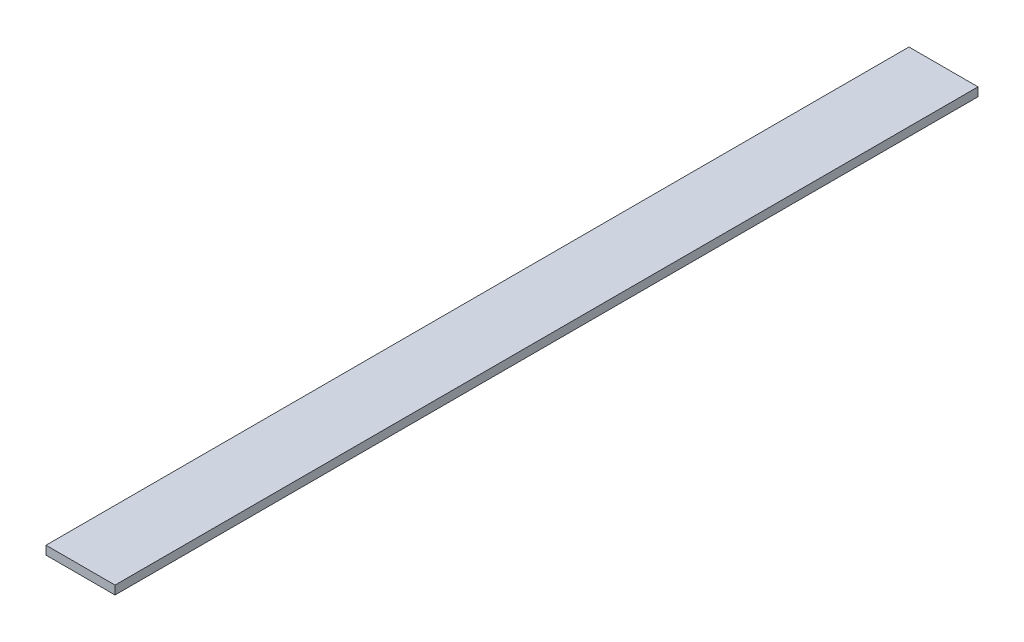
ISO-10303-21;
HEADER;
FILE_DESCRIPTION(('STEP AP214'),'2;1');
FILE_NAME('part.step','',(''),(''),'','','');
FILE_SCHEMA(('AUTOMOTIVE_DESIGN { 1 0 10303 214 1 1 1 1 }'));
ENDSEC;
DATA;
#1=APPLICATION_CONTEXT('core data for automotive mechanical design processes');
#2=APPLICATION_PROTOCOL_DEFINITION('international standard','automotive_design',2000,#1);
#3=PRODUCT_CONTEXT('',#1,'mechanical');
#4=PRODUCT('Part','Part','',(#3));
#5=PRODUCT_RELATED_PRODUCT_CATEGORY('part','',(#4));
#6=PRODUCT_DEFINITION_FORMATION('','',#4);
#7=PRODUCT_DEFINITION_CONTEXT('part definition',#1,'design');
#8=PRODUCT_DEFINITION('design','',#6,#7);
#9=PRODUCT_DEFINITION_SHAPE('','',#8);
#10=(LENGTH_UNIT() NAMED_UNIT(*) SI_UNIT(.MILLI.,.METRE.));
#11=(NAMED_UNIT(*) PLANE_ANGLE_UNIT() SI_UNIT($,.RADIAN.));
#12=(NAMED_UNIT(*) SI_UNIT($,.STERADIAN.) SOLID_ANGLE_UNIT());
#13=UNCERTAINTY_MEASURE_WITH_UNIT(LENGTH_MEASURE(1.E-05),#10,'distance_accuracy_value','');
#14=(GEOMETRIC_REPRESENTATION_CONTEXT(3) GLOBAL_UNCERTAINTY_ASSIGNED_CONTEXT((#13)) GLOBAL_UNIT_ASSIGNED_CONTEXT((#10,
#11,#12)) REPRESENTATION_CONTEXT('',''));
#15=CARTESIAN_POINT('',(0.,0.,0.));
#16=DIRECTION('',(0.,0.,1.));
#17=DIRECTION('',(1.,0.,0.));
#18=AXIS2_PLACEMENT_3D('',#15,#16,#17);
#19=CARTESIAN_POINT('',(0.,0.,500.));
#20=DIRECTION('',(1.,0.,0.));
#21=DIRECTION('',(0.,0.,-1.));
#22=AXIS2_PLACEMENT_3D('',#19,#20,#21);
#23=PLANE('',#22);
#24=DIRECTION('',(0.,-1.,0.));
#25=VECTOR('',#24,1.);
#26=CARTESIAN_POINT('',(0.,0.,0.));
#27=LINE('',#26,#25);
#28=CARTESIAN_POINT('',(0.,5.,0.));
#29=VERTEX_POINT('',#28);
#30=CARTESIAN_POINT('',(0.,0.,0.));
#31=VERTEX_POINT('',#30);
#32=EDGE_CURVE('E96',#29,#31,#27,.T.);
#33=ORIENTED_EDGE('',*,*,#32,.T.);
#34=DIRECTION('',(0.,0.,-1.));
#35=VECTOR('',#34,1.);
#36=CARTESIAN_POINT('',(0.,0.,500.));
#37=LINE('',#36,#35);
#38=CARTESIAN_POINT('',(0.,0.,500.));
#39=VERTEX_POINT('',#38);
#40=EDGE_CURVE('E11',#39,#31,#37,.T.);
#41=ORIENTED_EDGE('',*,*,#40,.F.);
#42=DIRECTION('',(0.,-1.,0.));
#43=VECTOR('',#42,1.);
#44=CARTESIAN_POINT('',(0.,0.,500.));
#45=LINE('',#44,#43);
#46=CARTESIAN_POINT('',(0.,5.,500.));
#47=VERTEX_POINT('',#46);
#48=EDGE_CURVE('E84',#47,#39,#45,.T.);
#49=ORIENTED_EDGE('',*,*,#48,.F.);
#50=DIRECTION('',(0.,0.,-1.));
#51=VECTOR('',#50,1.);
#52=CARTESIAN_POINT('',(0.,5.,500.));
#53=LINE('',#52,#51);
#54=EDGE_CURVE('E92',#47,#29,#53,.T.);
#55=ORIENTED_EDGE('',*,*,#54,.T.);
#56=EDGE_LOOP('',(#33,#41,#49,#55));
#57=FACE_BOUND('',#56,.T.);
#58=ADVANCED_FACE('F33',(#57),#23,.F.);
#59=CARTESIAN_POINT('',(0.,0.,500.));
#60=DIRECTION('',(0.,1.,0.));
#61=DIRECTION('',(0.,0.,1.));
#62=AXIS2_PLACEMENT_3D('',#59,#60,#61);
#63=PLANE('',#62);
#64=DIRECTION('',(1.,0.,0.));
#65=VECTOR('',#64,1.);
#66=CARTESIAN_POINT('',(0.,0.,0.));
#67=LINE('',#66,#65);
#68=CARTESIAN_POINT('',(40.,0.,0.));
#69=VERTEX_POINT('',#68);
#70=EDGE_CURVE('E88',#31,#69,#67,.T.);
#71=ORIENTED_EDGE('',*,*,#70,.T.);
#72=DIRECTION('',(0.,0.,-1.));
#73=VECTOR('',#72,1.);
#74=CARTESIAN_POINT('',(40.,0.,500.));
#75=LINE('',#74,#73);
#76=CARTESIAN_POINT('',(40.,0.,500.));
#77=VERTEX_POINT('',#76);
#78=EDGE_CURVE('E41',#77,#69,#75,.T.);
#79=ORIENTED_EDGE('',*,*,#78,.F.);
#80=DIRECTION('',(1.,0.,0.));
#81=VECTOR('',#80,1.);
#82=CARTESIAN_POINT('',(0.,0.,500.));
#83=LINE('',#82,#81);
#84=EDGE_CURVE('E79',#39,#77,#83,.T.);
#85=ORIENTED_EDGE('',*,*,#84,.F.);
#86=ORIENTED_EDGE('',*,*,#40,.T.);
#87=EDGE_LOOP('',(#71,#79,#85,#86));
#88=FACE_BOUND('',#87,.T.);
#89=ADVANCED_FACE('F87',(#88),#63,.F.);
#90=CARTESIAN_POINT('',(40.,0.,500.));
#91=DIRECTION('',(-1.,0.,0.));
#92=DIRECTION('',(0.,0.,1.));
#93=AXIS2_PLACEMENT_3D('',#90,#91,#92);
#94=PLANE('',#93);
#95=DIRECTION('',(0.,1.,0.));
#96=VECTOR('',#95,1.);
#97=CARTESIAN_POINT('',(40.,0.,0.));
#98=LINE('',#97,#96);
#99=CARTESIAN_POINT('',(40.,5.,0.));
#100=VERTEX_POINT('',#99);
#101=EDGE_CURVE('E66',#69,#100,#98,.T.);
#102=ORIENTED_EDGE('',*,*,#101,.T.);
#103=DIRECTION('',(0.,0.,-1.));
#104=VECTOR('',#103,1.);
#105=CARTESIAN_POINT('',(40.,5.,500.));
#106=LINE('',#105,#104);
#107=CARTESIAN_POINT('',(40.,5.,500.));
#108=VERTEX_POINT('',#107);
#109=EDGE_CURVE('E89',#108,#100,#106,.T.);
#110=ORIENTED_EDGE('',*,*,#109,.F.);
#111=DIRECTION('',(0.,1.,0.));
#112=VECTOR('',#111,1.);
#113=CARTESIAN_POINT('',(40.,0.,500.));
#114=LINE('',#113,#112);
#115=EDGE_CURVE('E82',#77,#108,#114,.T.);
#116=ORIENTED_EDGE('',*,*,#115,.F.);
#117=ORIENTED_EDGE('',*,*,#78,.T.);
#118=EDGE_LOOP('',(#102,#110,#116,#117));
#119=FACE_BOUND('',#118,.T.);
#120=ADVANCED_FACE('F90',(#119),#94,.F.);
#121=CARTESIAN_POINT('',(0.,5.,500.));
#122=DIRECTION('',(0.,-1.,0.));
#123=DIRECTION('',(0.,0.,-1.));
#124=AXIS2_PLACEMENT_3D('',#121,#122,#123);
#125=PLANE('',#124);
#126=DIRECTION('',(-1.,0.,0.));
#127=VECTOR('',#126,1.);
#128=CARTESIAN_POINT('',(0.,5.,0.));
#129=LINE('',#128,#127);
#130=EDGE_CURVE('E72',#100,#29,#129,.T.);
#131=ORIENTED_EDGE('',*,*,#130,.T.);
#132=ORIENTED_EDGE('',*,*,#54,.F.);
#133=DIRECTION('',(-1.,0.,0.));
#134=VECTOR('',#133,1.);
#135=CARTESIAN_POINT('',(0.,5.,500.));
#136=LINE('',#135,#134);
#137=EDGE_CURVE('E49',#108,#47,#136,.T.);
#138=ORIENTED_EDGE('',*,*,#137,.F.);
#139=ORIENTED_EDGE('',*,*,#109,.T.);
#140=EDGE_LOOP('',(#131,#132,#138,#139));
#141=FACE_BOUND('',#140,.T.);
#142=ADVANCED_FACE('F103',(#141),#125,.F.);
#143=CARTESIAN_POINT('',(0.,0.,500.));
#144=DIRECTION('',(0.,0.,-1.));
#145=DIRECTION('',(-1.,0.,0.));
#146=AXIS2_PLACEMENT_3D('',#143,#144,#145);
#147=PLANE('',#146);
#148=ORIENTED_EDGE('',*,*,#48,.T.);
#149=ORIENTED_EDGE('',*,*,#84,.T.);
#150=ORIENTED_EDGE('',*,*,#115,.T.);
#151=ORIENTED_EDGE('',*,*,#137,.T.);
#152=EDGE_LOOP('',(#148,#149,#150,#151));
#153=FACE_BOUND('',#152,.T.);
#154=ADVANCED_FACE('F80',(#153),#147,.F.);
#155=CARTESIAN_POINT('',(0.,0.,0.));
#156=DIRECTION('',(0.,0.,-1.));
#157=DIRECTION('',(-1.,0.,0.));
#158=AXIS2_PLACEMENT_3D('',#155,#156,#157);
#159=PLANE('',#158);
#160=ORIENTED_EDGE('',*,*,#32,.F.);
#161=ORIENTED_EDGE('',*,*,#130,.F.);
#162=ORIENTED_EDGE('',*,*,#101,.F.);
#163=ORIENTED_EDGE('',*,*,#70,.F.);
#164=EDGE_LOOP('',(#160,#161,#162,#163));
#165=FACE_BOUND('',#164,.T.);
#166=ADVANCED_FACE('F106',(#165),#159,.T.);
#167=CLOSED_SHELL('',(#58,#89,#120,#142,#154,#166));
#168=MANIFOLD_SOLID_BREP('B2',#167);
#169=ADVANCED_BREP_SHAPE_REPRESENTATION('',(#18,#168),#14);
#170=SHAPE_DEFINITION_REPRESENTATION(#9,#169);
ENDSEC;
END-ISO-10303-21;
